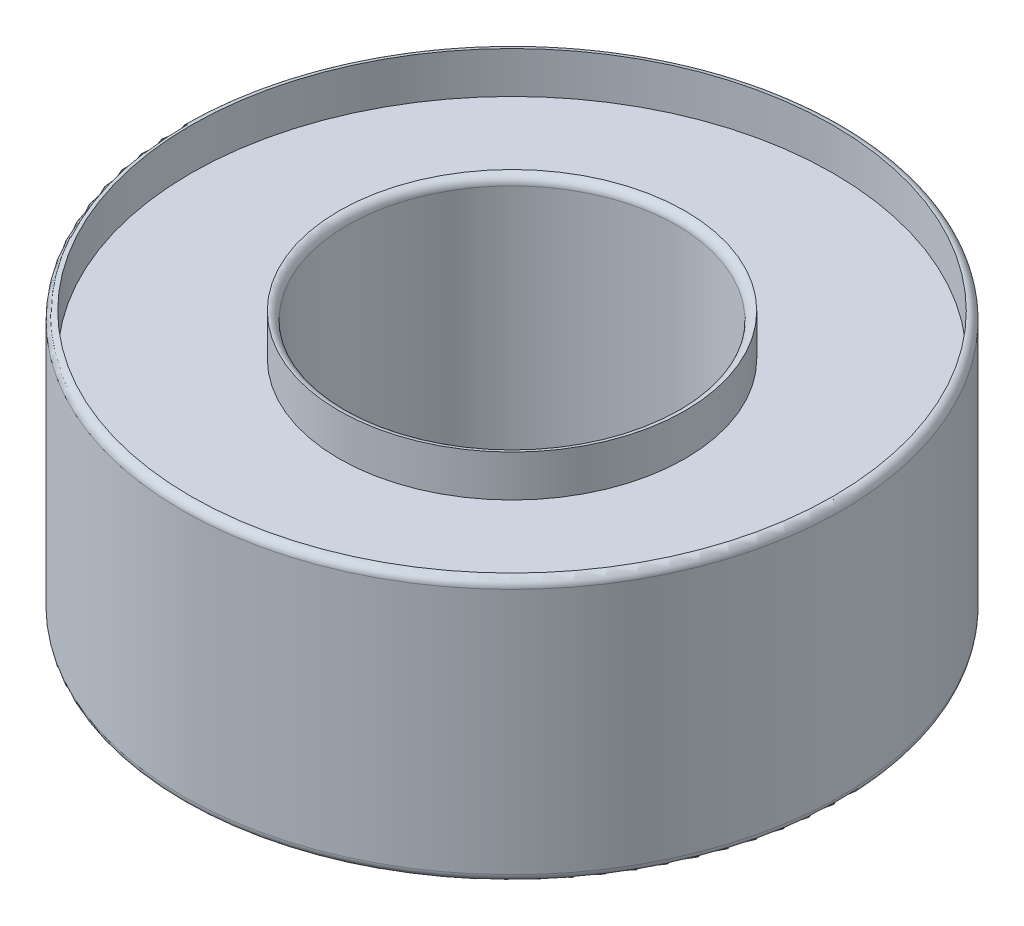
ISO-10303-21;
HEADER;
FILE_DESCRIPTION(('STEP AP214'),'2;1');
FILE_NAME('part.step','',(''),(''),'','','');
FILE_SCHEMA(('AUTOMOTIVE_DESIGN { 1 0 10303 214 1 1 1 1 }'));
ENDSEC;
DATA;
#1=APPLICATION_CONTEXT('core data for automotive mechanical design processes');
#2=APPLICATION_PROTOCOL_DEFINITION('international standard','automotive_design',2000,#1);
#3=PRODUCT_CONTEXT('',#1,'mechanical');
#4=PRODUCT('Part','Part','',(#3));
#5=PRODUCT_RELATED_PRODUCT_CATEGORY('part','',(#4));
#6=PRODUCT_DEFINITION_FORMATION('','',#4);
#7=PRODUCT_DEFINITION_CONTEXT('part definition',#1,'design');
#8=PRODUCT_DEFINITION('design','',#6,#7);
#9=PRODUCT_DEFINITION_SHAPE('','',#8);
#10=(LENGTH_UNIT() NAMED_UNIT(*) SI_UNIT(.MILLI.,.METRE.));
#11=(NAMED_UNIT(*) PLANE_ANGLE_UNIT() SI_UNIT($,.RADIAN.));
#12=(NAMED_UNIT(*) SI_UNIT($,.STERADIAN.) SOLID_ANGLE_UNIT());
#13=UNCERTAINTY_MEASURE_WITH_UNIT(LENGTH_MEASURE(1.E-05),#10,'distance_accuracy_value','');
#14=(GEOMETRIC_REPRESENTATION_CONTEXT(3) GLOBAL_UNCERTAINTY_ASSIGNED_CONTEXT((#13)) GLOBAL_UNIT_ASSIGNED_CONTEXT((#10,
#11,#12)) REPRESENTATION_CONTEXT('',''));
#15=CARTESIAN_POINT('',(0.,0.,0.));
#16=DIRECTION('',(0.,0.,1.));
#17=DIRECTION('',(1.,0.,0.));
#18=AXIS2_PLACEMENT_3D('',#15,#16,#17);
#19=CARTESIAN_POINT('',(0.,3.175,0.));
#20=DIRECTION('',(0.,-1.,0.));
#21=DIRECTION('',(0.,0.,-1.));
#22=AXIS2_PLACEMENT_3D('',#19,#20,#21);
#23=CYLINDRICAL_SURFACE('',#22,3.96875);
#24=CARTESIAN_POINT('',(0.,0.0999999999999998,0.));
#25=DIRECTION('',(0.,1.,0.));
#26=DIRECTION('',(0.,0.,1.));
#27=AXIS2_PLACEMENT_3D('',#24,#25,#26);
#28=CIRCLE('',#27,3.96875);
#29=CARTESIAN_POINT('',(0.,0.0999999999999998,3.96875));
#30=VERTEX_POINT('',#29);
#31=EDGE_CURVE('E10',#30,#30,#28,.T.);
#32=ORIENTED_EDGE('',*,*,#31,.T.);
#33=EDGE_LOOP('',(#32));
#34=FACE_BOUND('',#33,.T.);
#35=CARTESIAN_POINT('',(0.,3.075,0.));
#36=DIRECTION('',(0.,1.,0.));
#37=DIRECTION('',(0.,0.,1.));
#38=AXIS2_PLACEMENT_3D('',#35,#36,#37);
#39=CIRCLE('',#38,3.96875);
#40=CARTESIAN_POINT('',(0.,3.075,3.96875));
#41=VERTEX_POINT('',#40);
#42=EDGE_CURVE('E41',#41,#41,#39,.F.);
#43=ORIENTED_EDGE('',*,*,#42,.T.);
#44=EDGE_LOOP('',(#43));
#45=FACE_BOUND('',#44,.T.);
#46=ADVANCED_FACE('F34',(#34,#45),#23,.T.);
#47=CARTESIAN_POINT('',(0.,3.175,0.));
#48=DIRECTION('',(0.,-1.,0.));
#49=DIRECTION('',(0.,0.,-1.));
#50=AXIS2_PLACEMENT_3D('',#47,#48,#49);
#51=CYLINDRICAL_SURFACE('',#50,1.984375);
#52=CARTESIAN_POINT('',(0.,0.0999999999999998,0.));
#53=DIRECTION('',(0.,1.,0.));
#54=DIRECTION('',(0.,0.,1.));
#55=AXIS2_PLACEMENT_3D('',#52,#53,#54);
#56=CIRCLE('',#55,1.984375);
#57=CARTESIAN_POINT('',(0.,0.0999999999999998,1.984375));
#58=VERTEX_POINT('',#57);
#59=EDGE_CURVE('E45',#58,#58,#56,.F.);
#60=ORIENTED_EDGE('',*,*,#59,.T.);
#61=EDGE_LOOP('',(#60));
#62=FACE_BOUND('',#61,.T.);
#63=CARTESIAN_POINT('',(0.,3.075,0.));
#64=DIRECTION('',(0.,1.,0.));
#65=DIRECTION('',(0.,0.,1.));
#66=AXIS2_PLACEMENT_3D('',#63,#64,#65);
#67=CIRCLE('',#66,1.984375);
#68=CARTESIAN_POINT('',(0.,3.075,1.984375));
#69=VERTEX_POINT('',#68);
#70=EDGE_CURVE('E49',#69,#69,#67,.T.);
#71=ORIENTED_EDGE('',*,*,#70,.T.);
#72=EDGE_LOOP('',(#71));
#73=FACE_BOUND('',#72,.T.);
#74=ADVANCED_FACE('F109',(#62,#73),#51,.F.);
#75=CARTESIAN_POINT('',(0.,0.0999999999999998,0.));
#76=DIRECTION('',(0.,1.,0.));
#77=DIRECTION('',(0.,0.,1.));
#78=AXIS2_PLACEMENT_3D('',#75,#76,#77);
#79=TOROIDAL_SURFACE('',#78,2.084375,0.1);
#80=ORIENTED_EDGE('',*,*,#59,.F.);
#81=EDGE_LOOP('',(#80));
#82=FACE_BOUND('',#81,.T.);
#83=CARTESIAN_POINT('',(0.,0.,0.));
#84=DIRECTION('',(0.,-1.,0.));
#85=DIRECTION('',(0.,0.,-1.));
#86=AXIS2_PLACEMENT_3D('',#83,#84,#85);
#87=CIRCLE('',#86,2.084375);
#88=CARTESIAN_POINT('',(0.,0.,-2.084375));
#89=VERTEX_POINT('',#88);
#90=EDGE_CURVE('E73',#89,#89,#87,.T.);
#91=ORIENTED_EDGE('',*,*,#90,.T.);
#92=EDGE_LOOP('',(#91));
#93=FACE_BOUND('',#92,.T.);
#94=ADVANCED_FACE('F105',(#82,#93),#79,.T.);
#95=CARTESIAN_POINT('',(0.,3.075,0.));
#96=DIRECTION('',(0.,1.,0.));
#97=DIRECTION('',(0.,0.,1.));
#98=AXIS2_PLACEMENT_3D('',#95,#96,#97);
#99=TOROIDAL_SURFACE('',#98,2.084375,0.1);
#100=CARTESIAN_POINT('',(0.,3.175,0.));
#101=DIRECTION('',(0.,1.,0.));
#102=DIRECTION('',(0.,0.,1.));
#103=AXIS2_PLACEMENT_3D('',#100,#101,#102);
#104=CIRCLE('',#103,2.084375);
#105=CARTESIAN_POINT('',(0.,3.175,2.084375));
#106=VERTEX_POINT('',#105);
#107=EDGE_CURVE('E61',#106,#106,#104,.T.);
#108=ORIENTED_EDGE('',*,*,#107,.T.);
#109=EDGE_LOOP('',(#108));
#110=FACE_BOUND('',#109,.T.);
#111=ORIENTED_EDGE('',*,*,#70,.F.);
#112=EDGE_LOOP('',(#111));
#113=FACE_BOUND('',#112,.T.);
#114=ADVANCED_FACE('F98',(#110,#113),#99,.T.);
#115=CARTESIAN_POINT('',(0.,0.0999999999999998,0.));
#116=DIRECTION('',(0.,1.,0.));
#117=DIRECTION('',(0.,0.,1.));
#118=AXIS2_PLACEMENT_3D('',#115,#116,#117);
#119=TOROIDAL_SURFACE('',#118,3.86875,0.1);
#120=CARTESIAN_POINT('',(0.,0.,0.));
#121=DIRECTION('',(0.,-1.,0.));
#122=DIRECTION('',(0.,0.,-1.));
#123=AXIS2_PLACEMENT_3D('',#120,#121,#122);
#124=CIRCLE('',#123,3.86875);
#125=CARTESIAN_POINT('',(0.,0.,-3.86875));
#126=VERTEX_POINT('',#125);
#127=EDGE_CURVE('E67',#126,#126,#124,.T.);
#128=ORIENTED_EDGE('',*,*,#127,.F.);
#129=EDGE_LOOP('',(#128));
#130=FACE_BOUND('',#129,.T.);
#131=ORIENTED_EDGE('',*,*,#31,.F.);
#132=EDGE_LOOP('',(#131));
#133=FACE_BOUND('',#132,.T.);
#134=ADVANCED_FACE('F95',(#130,#133),#119,.T.);
#135=CARTESIAN_POINT('',(0.,3.075,0.));
#136=DIRECTION('',(0.,1.,0.));
#137=DIRECTION('',(0.,0.,1.));
#138=AXIS2_PLACEMENT_3D('',#135,#136,#137);
#139=TOROIDAL_SURFACE('',#138,3.86875,0.1);
#140=ORIENTED_EDGE('',*,*,#42,.F.);
#141=EDGE_LOOP('',(#140));
#142=FACE_BOUND('',#141,.T.);
#143=CARTESIAN_POINT('',(0.,3.175,0.));
#144=DIRECTION('',(0.,1.,0.));
#145=DIRECTION('',(0.,0.,1.));
#146=AXIS2_PLACEMENT_3D('',#143,#144,#145);
#147=CIRCLE('',#146,3.86875);
#148=CARTESIAN_POINT('',(0.,3.175,3.86875));
#149=VERTEX_POINT('',#148);
#150=EDGE_CURVE('E55',#149,#149,#147,.T.);
#151=ORIENTED_EDGE('',*,*,#150,.F.);
#152=EDGE_LOOP('',(#151));
#153=FACE_BOUND('',#152,.T.);
#154=ADVANCED_FACE('F36',(#142,#153),#139,.T.);
#155=CARTESIAN_POINT('',(0.,2.675,0.));
#156=DIRECTION('',(0.,1.,0.));
#157=DIRECTION('',(0.,0.,1.));
#158=AXIS2_PLACEMENT_3D('',#155,#156,#157);
#159=CYLINDRICAL_SURFACE('',#158,3.86875);
#160=CARTESIAN_POINT('',(0.,2.675,0.));
#161=DIRECTION('',(0.,1.,0.));
#162=DIRECTION('',(0.,0.,1.));
#163=AXIS2_PLACEMENT_3D('',#160,#161,#162);
#164=CIRCLE('',#163,3.86875);
#165=CARTESIAN_POINT('',(0.,2.675,3.86875));
#166=VERTEX_POINT('',#165);
#167=EDGE_CURVE('E54',#166,#166,#164,.T.);
#168=ORIENTED_EDGE('',*,*,#167,.F.);
#169=EDGE_LOOP('',(#168));
#170=FACE_BOUND('',#169,.T.);
#171=ORIENTED_EDGE('',*,*,#150,.T.);
#172=EDGE_LOOP('',(#171));
#173=FACE_BOUND('',#172,.T.);
#174=ADVANCED_FACE('F103',(#170,#173),#159,.F.);
#175=CARTESIAN_POINT('',(0.,2.675,0.));
#176=DIRECTION('',(0.,1.,0.));
#177=DIRECTION('',(0.,0.,1.));
#178=AXIS2_PLACEMENT_3D('',#175,#176,#177);
#179=PLANE('',#178);
#180=CARTESIAN_POINT('',(0.,2.675,0.));
#181=DIRECTION('',(0.,1.,0.));
#182=DIRECTION('',(0.,0.,1.));
#183=AXIS2_PLACEMENT_3D('',#180,#181,#182);
#184=CIRCLE('',#183,2.084375);
#185=CARTESIAN_POINT('',(0.,2.675,2.084375));
#186=VERTEX_POINT('',#185);
#187=EDGE_CURVE('E58',#186,#186,#184,.T.);
#188=ORIENTED_EDGE('',*,*,#187,.F.);
#189=EDGE_LOOP('',(#188));
#190=FACE_BOUND('',#189,.T.);
#191=ORIENTED_EDGE('',*,*,#167,.T.);
#192=EDGE_LOOP('',(#191));
#193=FACE_BOUND('',#192,.T.);
#194=ADVANCED_FACE('F132',(#190,#193),#179,.T.);
#195=CARTESIAN_POINT('',(0.,2.675,0.));
#196=DIRECTION('',(0.,1.,0.));
#197=DIRECTION('',(0.,0.,1.));
#198=AXIS2_PLACEMENT_3D('',#195,#196,#197);
#199=CYLINDRICAL_SURFACE('',#198,2.084375);
#200=ORIENTED_EDGE('',*,*,#187,.T.);
#201=EDGE_LOOP('',(#200));
#202=FACE_BOUND('',#201,.T.);
#203=ORIENTED_EDGE('',*,*,#107,.F.);
#204=EDGE_LOOP('',(#203));
#205=FACE_BOUND('',#204,.T.);
#206=ADVANCED_FACE('F91',(#202,#205),#199,.T.);
#207=CARTESIAN_POINT('',(0.,0.5,0.));
#208=DIRECTION('',(0.,-1.,0.));
#209=DIRECTION('',(0.,0.,-1.));
#210=AXIS2_PLACEMENT_3D('',#207,#208,#209);
#211=CYLINDRICAL_SURFACE('',#210,3.86875);
#212=CARTESIAN_POINT('',(0.,0.5,0.));
#213=DIRECTION('',(0.,-1.,0.));
#214=DIRECTION('',(0.,0.,-1.));
#215=AXIS2_PLACEMENT_3D('',#212,#213,#214);
#216=CIRCLE('',#215,3.86875);
#217=CARTESIAN_POINT('',(0.,0.5,-3.86875));
#218=VERTEX_POINT('',#217);
#219=EDGE_CURVE('E64',#218,#218,#216,.T.);
#220=ORIENTED_EDGE('',*,*,#219,.F.);
#221=EDGE_LOOP('',(#220));
#222=FACE_BOUND('',#221,.T.);
#223=ORIENTED_EDGE('',*,*,#127,.T.);
#224=EDGE_LOOP('',(#223));
#225=FACE_BOUND('',#224,.T.);
#226=ADVANCED_FACE('F85',(#222,#225),#211,.F.);
#227=CARTESIAN_POINT('',(0.,0.5,0.));
#228=DIRECTION('',(0.,-1.,0.));
#229=DIRECTION('',(0.,0.,-1.));
#230=AXIS2_PLACEMENT_3D('',#227,#228,#229);
#231=PLANE('',#230);
#232=CARTESIAN_POINT('',(0.,0.5,0.));
#233=DIRECTION('',(0.,-1.,0.));
#234=DIRECTION('',(0.,0.,-1.));
#235=AXIS2_PLACEMENT_3D('',#232,#233,#234);
#236=CIRCLE('',#235,2.084375);
#237=CARTESIAN_POINT('',(0.,0.5,-2.084375));
#238=VERTEX_POINT('',#237);
#239=EDGE_CURVE('E70',#238,#238,#236,.T.);
#240=ORIENTED_EDGE('',*,*,#239,.F.);
#241=EDGE_LOOP('',(#240));
#242=FACE_BOUND('',#241,.T.);
#243=ORIENTED_EDGE('',*,*,#219,.T.);
#244=EDGE_LOOP('',(#243));
#245=FACE_BOUND('',#244,.T.);
#246=ADVANCED_FACE('F82',(#242,#245),#231,.T.);
#247=CARTESIAN_POINT('',(0.,0.5,0.));
#248=DIRECTION('',(0.,-1.,0.));
#249=DIRECTION('',(0.,0.,-1.));
#250=AXIS2_PLACEMENT_3D('',#247,#248,#249);
#251=CYLINDRICAL_SURFACE('',#250,2.084375);
#252=ORIENTED_EDGE('',*,*,#239,.T.);
#253=EDGE_LOOP('',(#252));
#254=FACE_BOUND('',#253,.T.);
#255=ORIENTED_EDGE('',*,*,#90,.F.);
#256=EDGE_LOOP('',(#255));
#257=FACE_BOUND('',#256,.T.);
#258=ADVANCED_FACE('F79',(#254,#257),#251,.T.);
#259=CLOSED_SHELL('',(#46,#74,#94,#114,#134,#154,#174,#194,#206,#226,#246,#258));
#260=MANIFOLD_SOLID_BREP('B2',#259);
#261=ADVANCED_BREP_SHAPE_REPRESENTATION('',(#18,#260),#14);
#262=SHAPE_DEFINITION_REPRESENTATION(#9,#261);
ENDSEC;
END-ISO-10303-21;
